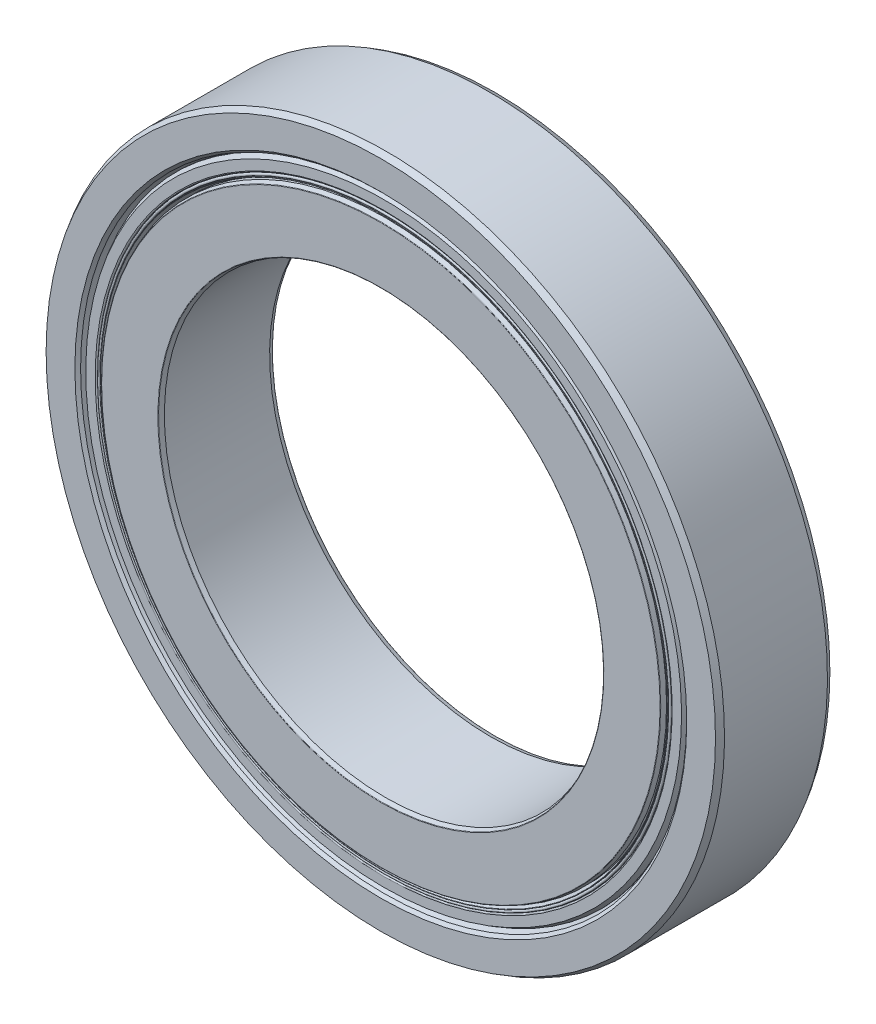
ISO-10303-21;
HEADER;
FILE_DESCRIPTION(('STEP AP214'),'2;1');
FILE_NAME('part.step','',(''),(''),'','','');
FILE_SCHEMA(('AUTOMOTIVE_DESIGN { 1 0 10303 214 1 1 1 1 }'));
ENDSEC;
DATA;
#1=APPLICATION_CONTEXT('core data for automotive mechanical design processes');
#2=APPLICATION_PROTOCOL_DEFINITION('international standard','automotive_design',2000,#1);
#3=PRODUCT_CONTEXT('',#1,'mechanical');
#4=PRODUCT('Part','Part','',(#3));
#5=PRODUCT_RELATED_PRODUCT_CATEGORY('part','',(#4));
#6=PRODUCT_DEFINITION_FORMATION('','',#4);
#7=PRODUCT_DEFINITION_CONTEXT('part definition',#1,'design');
#8=PRODUCT_DEFINITION('design','',#6,#7);
#9=PRODUCT_DEFINITION_SHAPE('','',#8);
#10=(LENGTH_UNIT() NAMED_UNIT(*) SI_UNIT(.MILLI.,.METRE.));
#11=(NAMED_UNIT(*) PLANE_ANGLE_UNIT() SI_UNIT($,.RADIAN.));
#12=(NAMED_UNIT(*) SI_UNIT($,.STERADIAN.) SOLID_ANGLE_UNIT());
#13=UNCERTAINTY_MEASURE_WITH_UNIT(LENGTH_MEASURE(1.E-05),#10,'distance_accuracy_value','');
#14=(GEOMETRIC_REPRESENTATION_CONTEXT(3) GLOBAL_UNCERTAINTY_ASSIGNED_CONTEXT((#13)) GLOBAL_UNIT_ASSIGNED_CONTEXT((#10,
#11,#12)) REPRESENTATION_CONTEXT('',''));
#15=CARTESIAN_POINT('',(0.,0.,0.));
#16=DIRECTION('',(0.,0.,1.));
#17=DIRECTION('',(1.,0.,0.));
#18=AXIS2_PLACEMENT_3D('',#15,#16,#17);
#19=CARTESIAN_POINT('',(0.,0.,11.));
#20=DIRECTION('',(0.,0.,1.));
#21=DIRECTION('',(0.,-1.,0.));
#22=AXIS2_PLACEMENT_3D('',#19,#20,#21);
#23=CYLINDRICAL_SURFACE('',#22,55.2001046153846);
#24=CARTESIAN_POINT('',(0.,0.,-5.4624476923077));
#25=DIRECTION('',(0.,0.,1.));
#26=DIRECTION('',(0.,-1.,0.));
#27=AXIS2_PLACEMENT_3D('',#24,#25,#26);
#28=CIRCLE('',#27,55.2001046153846);
#29=CARTESIAN_POINT('',(0.,-55.2001046153846,-5.46244769230771));
#30=VERTEX_POINT('',#29);
#31=EDGE_CURVE('E11',#30,#30,#28,.T.);
#32=ORIENTED_EDGE('',*,*,#31,.F.);
#33=EDGE_LOOP('',(#32));
#34=FACE_BOUND('',#33,.T.);
#35=CARTESIAN_POINT('',(0.,0.,-10.16875));
#36=DIRECTION('',(0.,0.,1.));
#37=DIRECTION('',(0.,-1.,0.));
#38=AXIS2_PLACEMENT_3D('',#35,#36,#37);
#39=CIRCLE('',#38,55.2001046153846);
#40=CARTESIAN_POINT('',(0.,-55.2001046153846,-10.16875));
#41=VERTEX_POINT('',#40);
#42=EDGE_CURVE('E77',#41,#41,#39,.T.);
#43=ORIENTED_EDGE('',*,*,#42,.T.);
#44=EDGE_LOOP('',(#43));
#45=FACE_BOUND('',#44,.T.);
#46=ADVANCED_FACE('F52',(#34,#45),#23,.T.);
#47=CARTESIAN_POINT('',(0.,55.2001046153846,-5.46244769230769));
#48=DIRECTION('',(0.,0.,-1.));
#49=DIRECTION('',(0.,1.,0.));
#50=AXIS2_PLACEMENT_3D('',#47,#48,#49);
#51=PLANE('',#50);
#52=CARTESIAN_POINT('',(0.,0.,-5.4624476923077));
#53=DIRECTION('',(0.,0.,1.));
#54=DIRECTION('',(0.,-1.,0.));
#55=AXIS2_PLACEMENT_3D('',#52,#53,#54);
#56=CIRCLE('',#55,54.0751046153846);
#57=CARTESIAN_POINT('',(0.,-54.0751046153846,-5.46244769230771));
#58=VERTEX_POINT('',#57);
#59=EDGE_CURVE('E58',#58,#58,#56,.T.);
#60=ORIENTED_EDGE('',*,*,#59,.F.);
#61=EDGE_LOOP('',(#60));
#62=FACE_BOUND('',#61,.T.);
#63=ORIENTED_EDGE('',*,*,#31,.T.);
#64=EDGE_LOOP('',(#63));
#65=FACE_BOUND('',#64,.T.);
#66=ADVANCED_FACE('F108',(#62,#65),#51,.F.);
#67=CARTESIAN_POINT('',(0.,0.,11.));
#68=DIRECTION('',(0.,0.,1.));
#69=DIRECTION('',(0.,-1.,0.));
#70=AXIS2_PLACEMENT_3D('',#67,#68,#69);
#71=CYLINDRICAL_SURFACE('',#70,54.0751046153846);
#72=CARTESIAN_POINT('',(0.,0.,-9.16146445163574));
#73=DIRECTION('',(0.,0.,1.));
#74=DIRECTION('',(0.,-1.,0.));
#75=AXIS2_PLACEMENT_3D('',#72,#73,#74);
#76=CIRCLE('',#75,54.0751046153846);
#77=CARTESIAN_POINT('',(0.,-54.0751046153846,-9.16146445163576));
#78=VERTEX_POINT('',#77);
#79=EDGE_CURVE('E62',#78,#78,#76,.T.);
#80=ORIENTED_EDGE('',*,*,#79,.F.);
#81=EDGE_LOOP('',(#80));
#82=FACE_BOUND('',#81,.T.);
#83=ORIENTED_EDGE('',*,*,#59,.T.);
#84=EDGE_LOOP('',(#83));
#85=FACE_BOUND('',#84,.T.);
#86=ADVANCED_FACE('F103',(#82,#85),#71,.F.);
#87=CARTESIAN_POINT('',(0.,0.,-9.16146445163574));
#88=DIRECTION('',(0.,0.,-1.));
#89=DIRECTION('',(0.,1.,0.));
#90=AXIS2_PLACEMENT_3D('',#87,#88,#89);
#91=CONICAL_SURFACE('',#90,54.0751046153846,0.34906585039886);
#92=CARTESIAN_POINT('',(0.,0.,-10.4138111078829));
#93=DIRECTION('',(0.,0.,1.));
#94=DIRECTION('',(0.,-1.,0.));
#95=AXIS2_PLACEMENT_3D('',#92,#93,#94);
#96=CIRCLE('',#95,54.5309215212414);
#97=CARTESIAN_POINT('',(0.,-54.5309215212414,-10.4138111078829));
#98=VERTEX_POINT('',#97);
#99=EDGE_CURVE('E66',#98,#98,#96,.T.);
#100=ORIENTED_EDGE('',*,*,#99,.F.);
#101=EDGE_LOOP('',(#100));
#102=FACE_BOUND('',#101,.T.);
#103=ORIENTED_EDGE('',*,*,#79,.T.);
#104=EDGE_LOOP('',(#103));
#105=FACE_BOUND('',#104,.T.);
#106=ADVANCED_FACE('F97',(#102,#105),#91,.F.);
#107=CARTESIAN_POINT('',(0.,0.,-10.395));
#108=DIRECTION('',(0.,0.,1.));
#109=DIRECTION('',(0.,-1.,0.));
#110=AXIS2_PLACEMENT_3D('',#107,#108,#109);
#111=TOROIDAL_SURFACE('',#110,54.5826046153846,0.0550000000000032);
#112=CARTESIAN_POINT('',(0.,0.,-10.395));
#113=DIRECTION('',(0.,0.,1.));
#114=DIRECTION('',(0.,-1.,0.));
#115=AXIS2_PLACEMENT_3D('',#112,#113,#114);
#116=CIRCLE('',#115,54.6376046153846);
#117=CARTESIAN_POINT('',(0.,-54.6376046153846,-10.395));
#118=VERTEX_POINT('',#117);
#119=EDGE_CURVE('E71',#118,#118,#116,.T.);
#120=ORIENTED_EDGE('',*,*,#119,.F.);
#121=EDGE_LOOP('',(#120));
#122=FACE_BOUND('',#121,.T.);
#123=ORIENTED_EDGE('',*,*,#99,.T.);
#124=EDGE_LOOP('',(#123));
#125=FACE_BOUND('',#124,.T.);
#126=ADVANCED_FACE('F91',(#122,#125),#111,.T.);
#127=CARTESIAN_POINT('',(0.,0.,11.));
#128=DIRECTION('',(0.,0.,1.));
#129=DIRECTION('',(0.,-1.,0.));
#130=AXIS2_PLACEMENT_3D('',#127,#128,#129);
#131=CYLINDRICAL_SURFACE('',#130,54.6376046153846);
#132=CARTESIAN_POINT('',(0.,0.,-10.16875));
#133=DIRECTION('',(0.,0.,1.));
#134=DIRECTION('',(0.,-1.,0.));
#135=AXIS2_PLACEMENT_3D('',#132,#133,#134);
#136=CIRCLE('',#135,54.6376046153846);
#137=CARTESIAN_POINT('',(0.,-54.6376046153846,-10.16875));
#138=VERTEX_POINT('',#137);
#139=EDGE_CURVE('E74',#138,#138,#136,.T.);
#140=ORIENTED_EDGE('',*,*,#139,.F.);
#141=EDGE_LOOP('',(#140));
#142=FACE_BOUND('',#141,.T.);
#143=ORIENTED_EDGE('',*,*,#119,.T.);
#144=EDGE_LOOP('',(#143));
#145=FACE_BOUND('',#144,.T.);
#146=ADVANCED_FACE('F85',(#142,#145),#131,.T.);
#147=CARTESIAN_POINT('',(0.,0.,-10.16875));
#148=DIRECTION('',(0.,0.,1.));
#149=DIRECTION('',(0.,-1.,0.));
#150=AXIS2_PLACEMENT_3D('',#147,#148,#149);
#151=TOROIDAL_SURFACE('',#150,54.9188546153846,0.281249999999997);
#152=ORIENTED_EDGE('',*,*,#42,.F.);
#153=EDGE_LOOP('',(#152));
#154=FACE_BOUND('',#153,.T.);
#155=ORIENTED_EDGE('',*,*,#139,.T.);
#156=EDGE_LOOP('',(#155));
#157=FACE_BOUND('',#156,.T.);
#158=ADVANCED_FACE('F82',(#154,#157),#151,.T.);
#159=CLOSED_SHELL('',(#46,#66,#86,#106,#126,#146,#158));
#160=MANIFOLD_SOLID_BREP('B2',#159);
#161=CARTESIAN_POINT('',(0.,55.2001046153846,5.4624476923077));
#162=DIRECTION('',(0.,0.,1.));
#163=DIRECTION('',(0.,-1.,0.));
#164=AXIS2_PLACEMENT_3D('',#161,#162,#163);
#165=PLANE('',#164);
#166=CARTESIAN_POINT('',(0.,0.,5.46244769230769));
#167=DIRECTION('',(0.,0.,1.));
#168=DIRECTION('',(0.,-1.,0.));
#169=AXIS2_PLACEMENT_3D('',#166,#167,#168);
#170=CIRCLE('',#169,55.2001046153846);
#171=CARTESIAN_POINT('',(0.,-55.2001046153846,5.46244769230768));
#172=VERTEX_POINT('',#171);
#173=EDGE_CURVE('E178',#172,#172,#170,.T.);
#174=ORIENTED_EDGE('',*,*,#173,.F.);
#175=EDGE_LOOP('',(#174));
#176=FACE_BOUND('',#175,.T.);
#177=CARTESIAN_POINT('',(0.,0.,5.46244769230769));
#178=DIRECTION('',(0.,0.,1.));
#179=DIRECTION('',(0.,-1.,0.));
#180=AXIS2_PLACEMENT_3D('',#177,#178,#179);
#181=CIRCLE('',#180,54.0751046153846);
#182=CARTESIAN_POINT('',(0.,-54.0751046153846,5.46244769230768));
#183=VERTEX_POINT('',#182);
#184=EDGE_CURVE('E51',#183,#183,#181,.T.);
#185=ORIENTED_EDGE('',*,*,#184,.T.);
#186=EDGE_LOOP('',(#185));
#187=FACE_BOUND('',#186,.T.);
#188=ADVANCED_FACE('F153',(#176,#187),#165,.F.);
#189=CARTESIAN_POINT('',(0.,0.,11.));
#190=DIRECTION('',(0.,0.,1.));
#191=DIRECTION('',(0.,-1.,0.));
#192=AXIS2_PLACEMENT_3D('',#189,#190,#191);
#193=CYLINDRICAL_SURFACE('',#192,54.0751046153846);
#194=ORIENTED_EDGE('',*,*,#184,.F.);
#195=EDGE_LOOP('',(#194));
#196=FACE_BOUND('',#195,.T.);
#197=CARTESIAN_POINT('',(0.,0.,9.16146445163573));
#198=DIRECTION('',(0.,0.,1.));
#199=DIRECTION('',(0.,-1.,0.));
#200=AXIS2_PLACEMENT_3D('',#197,#198,#199);
#201=CIRCLE('',#200,54.0751046153846);
#202=CARTESIAN_POINT('',(0.,-54.0751046153846,9.16146445163572));
#203=VERTEX_POINT('',#202);
#204=EDGE_CURVE('E159',#203,#203,#201,.T.);
#205=ORIENTED_EDGE('',*,*,#204,.T.);
#206=EDGE_LOOP('',(#205));
#207=FACE_BOUND('',#206,.T.);
#208=ADVANCED_FACE('F185',(#196,#207),#193,.F.);
#209=CARTESIAN_POINT('',(0.,0.,10.4138111078829));
#210=DIRECTION('',(0.,0.,1.));
#211=DIRECTION('',(0.,-1.,0.));
#212=AXIS2_PLACEMENT_3D('',#209,#210,#211);
#213=CONICAL_SURFACE('',#212,54.5309215212414,0.34906585039886);
#214=ORIENTED_EDGE('',*,*,#204,.F.);
#215=EDGE_LOOP('',(#214));
#216=FACE_BOUND('',#215,.T.);
#217=CARTESIAN_POINT('',(0.,0.,10.4138111078829));
#218=DIRECTION('',(0.,0.,1.));
#219=DIRECTION('',(0.,-1.,0.));
#220=AXIS2_PLACEMENT_3D('',#217,#218,#219);
#221=CIRCLE('',#220,54.5309215212414);
#222=CARTESIAN_POINT('',(0.,-54.5309215212414,10.4138111078829));
#223=VERTEX_POINT('',#222);
#224=EDGE_CURVE('E163',#223,#223,#221,.T.);
#225=ORIENTED_EDGE('',*,*,#224,.T.);
#226=EDGE_LOOP('',(#225));
#227=FACE_BOUND('',#226,.T.);
#228=ADVANCED_FACE('F189',(#216,#227),#213,.F.);
#229=CARTESIAN_POINT('',(0.,0.,10.395));
#230=DIRECTION('',(0.,0.,1.));
#231=DIRECTION('',(0.,-1.,0.));
#232=AXIS2_PLACEMENT_3D('',#229,#230,#231);
#233=TOROIDAL_SURFACE('',#232,54.5826046153846,0.0550000000000032);
#234=ORIENTED_EDGE('',*,*,#224,.F.);
#235=EDGE_LOOP('',(#234));
#236=FACE_BOUND('',#235,.T.);
#237=CARTESIAN_POINT('',(0.,0.,10.395));
#238=DIRECTION('',(0.,0.,1.));
#239=DIRECTION('',(0.,-1.,0.));
#240=AXIS2_PLACEMENT_3D('',#237,#238,#239);
#241=CIRCLE('',#240,54.6376046153846);
#242=CARTESIAN_POINT('',(0.,-54.6376046153846,10.395));
#243=VERTEX_POINT('',#242);
#244=EDGE_CURVE('E167',#243,#243,#241,.T.);
#245=ORIENTED_EDGE('',*,*,#244,.T.);
#246=EDGE_LOOP('',(#245));
#247=FACE_BOUND('',#246,.T.);
#248=ADVANCED_FACE('F194',(#236,#247),#233,.T.);
#249=CARTESIAN_POINT('',(0.,0.,11.));
#250=DIRECTION('',(0.,0.,1.));
#251=DIRECTION('',(0.,-1.,0.));
#252=AXIS2_PLACEMENT_3D('',#249,#250,#251);
#253=CYLINDRICAL_SURFACE('',#252,54.6376046153846);
#254=ORIENTED_EDGE('',*,*,#244,.F.);
#255=EDGE_LOOP('',(#254));
#256=FACE_BOUND('',#255,.T.);
#257=CARTESIAN_POINT('',(0.,0.,10.16875));
#258=DIRECTION('',(0.,0.,1.));
#259=DIRECTION('',(0.,-1.,0.));
#260=AXIS2_PLACEMENT_3D('',#257,#258,#259);
#261=CIRCLE('',#260,54.6376046153846);
#262=CARTESIAN_POINT('',(0.,-54.6376046153846,10.16875));
#263=VERTEX_POINT('',#262);
#264=EDGE_CURVE('E172',#263,#263,#261,.T.);
#265=ORIENTED_EDGE('',*,*,#264,.T.);
#266=EDGE_LOOP('',(#265));
#267=FACE_BOUND('',#266,.T.);
#268=ADVANCED_FACE('F200',(#256,#267),#253,.T.);
#269=CARTESIAN_POINT('',(0.,0.,10.16875));
#270=DIRECTION('',(0.,0.,1.));
#271=DIRECTION('',(0.,-1.,0.));
#272=AXIS2_PLACEMENT_3D('',#269,#270,#271);
#273=TOROIDAL_SURFACE('',#272,54.9188546153846,0.281249999999997);
#274=ORIENTED_EDGE('',*,*,#264,.F.);
#275=EDGE_LOOP('',(#274));
#276=FACE_BOUND('',#275,.T.);
#277=CARTESIAN_POINT('',(0.,0.,10.16875));
#278=DIRECTION('',(0.,0.,1.));
#279=DIRECTION('',(0.,-1.,0.));
#280=AXIS2_PLACEMENT_3D('',#277,#278,#279);
#281=CIRCLE('',#280,55.2001046153846);
#282=CARTESIAN_POINT('',(0.,-55.2001046153846,10.16875));
#283=VERTEX_POINT('',#282);
#284=EDGE_CURVE('E175',#283,#283,#281,.T.);
#285=ORIENTED_EDGE('',*,*,#284,.T.);
#286=EDGE_LOOP('',(#285));
#287=FACE_BOUND('',#286,.T.);
#288=ADVANCED_FACE('F204',(#276,#287),#273,.T.);
#289=CARTESIAN_POINT('',(0.,0.,11.));
#290=DIRECTION('',(0.,0.,1.));
#291=DIRECTION('',(0.,-1.,0.));
#292=AXIS2_PLACEMENT_3D('',#289,#290,#291);
#293=CYLINDRICAL_SURFACE('',#292,55.2001046153846);
#294=ORIENTED_EDGE('',*,*,#284,.F.);
#295=EDGE_LOOP('',(#294));
#296=FACE_BOUND('',#295,.T.);
#297=ORIENTED_EDGE('',*,*,#173,.T.);
#298=EDGE_LOOP('',(#297));
#299=FACE_BOUND('',#298,.T.);
#300=ADVANCED_FACE('F182',(#296,#299),#293,.T.);
#301=CLOSED_SHELL('',(#188,#208,#228,#248,#268,#288,#300));
#302=MANIFOLD_SOLID_BREP('B6',#301);
#303=CARTESIAN_POINT('',(0.,0.,-10.45));
#304=DIRECTION('',(0.,0.,1.));
#305=DIRECTION('',(0.,-1.,0.));
#306=AXIS2_PLACEMENT_3D('',#303,#304,#305);
#307=CONICAL_SURFACE('',#306,57.2875,0.523598775598289);
#308=CARTESIAN_POINT('',(0.,0.,-9.47572142074249));
#309=DIRECTION('',(0.,0.,1.));
#310=DIRECTION('',(0.,-1.,0.));
#311=AXIS2_PLACEMENT_3D('',#308,#309,#310);
#312=CIRCLE('',#311,57.85);
#313=CARTESIAN_POINT('',(0.,-57.85,-9.4757214207425));
#314=VERTEX_POINT('',#313);
#315=EDGE_CURVE('E276',#314,#314,#312,.T.);
#316=ORIENTED_EDGE('',*,*,#315,.F.);
#317=EDGE_LOOP('',(#316));
#318=FACE_BOUND('',#317,.T.);
#319=CARTESIAN_POINT('',(0.,0.,-10.45));
#320=DIRECTION('',(0.,0.,1.));
#321=DIRECTION('',(0.,-1.,0.));
#322=AXIS2_PLACEMENT_3D('',#319,#320,#321);
#323=CIRCLE('',#322,57.2875);
#324=CARTESIAN_POINT('',(0.,-57.2875,-10.45));
#325=VERTEX_POINT('',#324);
#326=EDGE_CURVE('E152',#325,#325,#323,.T.);
#327=ORIENTED_EDGE('',*,*,#326,.T.);
#328=EDGE_LOOP('',(#327));
#329=FACE_BOUND('',#328,.T.);
#330=ADVANCED_FACE('F254',(#318,#329),#307,.T.);
#331=CARTESIAN_POINT('',(0.,57.2875,-10.45));
#332=DIRECTION('',(0.,0.,1.));
#333=DIRECTION('',(0.,-1.,0.));
#334=AXIS2_PLACEMENT_3D('',#331,#332,#333);
#335=PLANE('',#334);
#336=ORIENTED_EDGE('',*,*,#326,.F.);
#337=EDGE_LOOP('',(#336));
#338=FACE_BOUND('',#337,.T.);
#339=CARTESIAN_POINT('',(0.,0.,-10.45));
#340=DIRECTION('',(0.,0.,1.));
#341=DIRECTION('',(0.,-1.,0.));
#342=AXIS2_PLACEMENT_3D('',#339,#340,#341);
#343=CIRCLE('',#342,55.4813546153846);
#344=CARTESIAN_POINT('',(0.,-55.4813546153846,-10.45));
#345=VERTEX_POINT('',#344);
#346=EDGE_CURVE('E260',#345,#345,#343,.T.);
#347=ORIENTED_EDGE('',*,*,#346,.T.);
#348=EDGE_LOOP('',(#347));
#349=FACE_BOUND('',#348,.T.);
#350=ADVANCED_FACE('F283',(#338,#349),#335,.F.);
#351=CARTESIAN_POINT('',(0.,0.,-10.16875));
#352=DIRECTION('',(0.,0.,1.));
#353=DIRECTION('',(0.,-1.,0.));
#354=AXIS2_PLACEMENT_3D('',#351,#352,#353);
#355=TOROIDAL_SURFACE('',#354,55.4813546153846,0.281250000000001);
#356=ORIENTED_EDGE('',*,*,#346,.F.);
#357=EDGE_LOOP('',(#356));
#358=FACE_BOUND('',#357,.T.);
#359=CARTESIAN_POINT('',(0.,0.,-10.16875));
#360=DIRECTION('',(0.,0.,1.));
#361=DIRECTION('',(0.,-1.,0.));
#362=AXIS2_PLACEMENT_3D('',#359,#360,#361);
#363=CIRCLE('',#362,55.2001046153846);
#364=CARTESIAN_POINT('',(0.,-55.2001046153846,-10.16875));
#365=VERTEX_POINT('',#364);
#366=EDGE_CURVE('E264',#365,#365,#363,.T.);
#367=ORIENTED_EDGE('',*,*,#366,.T.);
#368=EDGE_LOOP('',(#367));
#369=FACE_BOUND('',#368,.T.);
#370=ADVANCED_FACE('F287',(#358,#369),#355,.T.);
#371=CARTESIAN_POINT('',(0.,0.,11.));
#372=DIRECTION('',(0.,0.,1.));
#373=DIRECTION('',(0.,-1.,0.));
#374=AXIS2_PLACEMENT_3D('',#371,#372,#373);
#375=CYLINDRICAL_SURFACE('',#374,55.2001046153846);
#376=ORIENTED_EDGE('',*,*,#366,.F.);
#377=EDGE_LOOP('',(#376));
#378=FACE_BOUND('',#377,.T.);
#379=CARTESIAN_POINT('',(0.,0.,-5.4624476923077));
#380=DIRECTION('',(0.,0.,1.));
#381=DIRECTION('',(0.,-1.,0.));
#382=AXIS2_PLACEMENT_3D('',#379,#380,#381);
#383=CIRCLE('',#382,55.2001046153846);
#384=CARTESIAN_POINT('',(0.,-55.2001046153846,-5.46244769230771));
#385=VERTEX_POINT('',#384);
#386=EDGE_CURVE('E268',#385,#385,#383,.T.);
#387=ORIENTED_EDGE('',*,*,#386,.T.);
#388=EDGE_LOOP('',(#387));
#389=FACE_BOUND('',#388,.T.);
#390=ADVANCED_FACE('F292',(#378,#389),#375,.F.);
#391=CARTESIAN_POINT('',(0.,57.85,-5.46244769230769));
#392=DIRECTION('',(0.,0.,-1.));
#393=DIRECTION('',(0.,1.,0.));
#394=AXIS2_PLACEMENT_3D('',#391,#392,#393);
#395=PLANE('',#394);
#396=ORIENTED_EDGE('',*,*,#386,.F.);
#397=EDGE_LOOP('',(#396));
#398=FACE_BOUND('',#397,.T.);
#399=CARTESIAN_POINT('',(0.,0.,-5.4624476923077));
#400=DIRECTION('',(0.,0.,1.));
#401=DIRECTION('',(0.,-1.,0.));
#402=AXIS2_PLACEMENT_3D('',#399,#400,#401);
#403=CIRCLE('',#402,57.85);
#404=CARTESIAN_POINT('',(0.,-57.85,-5.46244769230771));
#405=VERTEX_POINT('',#404);
#406=EDGE_CURVE('E273',#405,#405,#403,.T.);
#407=ORIENTED_EDGE('',*,*,#406,.T.);
#408=EDGE_LOOP('',(#407));
#409=FACE_BOUND('',#408,.T.);
#410=ADVANCED_FACE('F298',(#398,#409),#395,.F.);
#411=CARTESIAN_POINT('',(0.,0.,11.));
#412=DIRECTION('',(0.,0.,1.));
#413=DIRECTION('',(0.,-1.,0.));
#414=AXIS2_PLACEMENT_3D('',#411,#412,#413);
#415=CYLINDRICAL_SURFACE('',#414,57.85);
#416=ORIENTED_EDGE('',*,*,#406,.F.);
#417=EDGE_LOOP('',(#416));
#418=FACE_BOUND('',#417,.T.);
#419=ORIENTED_EDGE('',*,*,#315,.T.);
#420=EDGE_LOOP('',(#419));
#421=FACE_BOUND('',#420,.T.);
#422=ADVANCED_FACE('F280',(#418,#421),#415,.T.);
#423=CLOSED_SHELL('',(#330,#350,#370,#390,#410,#422));
#424=MANIFOLD_SOLID_BREP('B46',#423);
#425=CARTESIAN_POINT('',(0.,57.85,5.4624476923077));
#426=DIRECTION('',(0.,0.,1.));
#427=DIRECTION('',(0.,-1.,0.));
#428=AXIS2_PLACEMENT_3D('',#425,#426,#427);
#429=PLANE('',#428);
#430=CARTESIAN_POINT('',(0.,0.,5.46244769230769));
#431=DIRECTION('',(0.,0.,1.));
#432=DIRECTION('',(0.,-1.,0.));
#433=AXIS2_PLACEMENT_3D('',#430,#431,#432);
#434=CIRCLE('',#433,57.85);
#435=CARTESIAN_POINT('',(0.,-57.85,5.46244769230768));
#436=VERTEX_POINT('',#435);
#437=EDGE_CURVE('E253',#436,#436,#434,.T.);
#438=ORIENTED_EDGE('',*,*,#437,.F.);
#439=EDGE_LOOP('',(#438));
#440=FACE_BOUND('',#439,.T.);
#441=CARTESIAN_POINT('',(0.,0.,5.46244769230769));
#442=DIRECTION('',(0.,0.,1.));
#443=DIRECTION('',(0.,-1.,0.));
#444=AXIS2_PLACEMENT_3D('',#441,#442,#443);
#445=CIRCLE('',#444,55.2001046153846);
#446=CARTESIAN_POINT('',(0.,-55.2001046153846,5.46244769230768));
#447=VERTEX_POINT('',#446);
#448=EDGE_CURVE('E362',#447,#447,#445,.T.);
#449=ORIENTED_EDGE('',*,*,#448,.T.);
#450=EDGE_LOOP('',(#449));
#451=FACE_BOUND('',#450,.T.);
#452=ADVANCED_FACE('F340',(#440,#451),#429,.F.);
#453=CARTESIAN_POINT('',(0.,0.,11.));
#454=DIRECTION('',(0.,0.,1.));
#455=DIRECTION('',(0.,-1.,0.));
#456=AXIS2_PLACEMENT_3D('',#453,#454,#455);
#457=CYLINDRICAL_SURFACE('',#456,57.85);
#458=CARTESIAN_POINT('',(0.,0.,9.47572142074248));
#459=DIRECTION('',(0.,0.,1.));
#460=DIRECTION('',(0.,-1.,0.));
#461=AXIS2_PLACEMENT_3D('',#458,#459,#460);
#462=CIRCLE('',#461,57.85);
#463=CARTESIAN_POINT('',(0.,-57.85,9.47572142074246));
#464=VERTEX_POINT('',#463);
#465=EDGE_CURVE('E346',#464,#464,#462,.T.);
#466=ORIENTED_EDGE('',*,*,#465,.F.);
#467=EDGE_LOOP('',(#466));
#468=FACE_BOUND('',#467,.T.);
#469=ORIENTED_EDGE('',*,*,#437,.T.);
#470=EDGE_LOOP('',(#469));
#471=FACE_BOUND('',#470,.T.);
#472=ADVANCED_FACE('F387',(#468,#471),#457,.T.);
#473=CARTESIAN_POINT('',(0.,0.,9.47572142074248));
#474=DIRECTION('',(0.,0.,-1.));
#475=DIRECTION('',(0.,1.,0.));
#476=AXIS2_PLACEMENT_3D('',#473,#474,#475);
#477=CONICAL_SURFACE('',#476,57.85,0.523598775598289);
#478=CARTESIAN_POINT('',(0.,0.,10.45));
#479=DIRECTION('',(0.,0.,1.));
#480=DIRECTION('',(0.,-1.,0.));
#481=AXIS2_PLACEMENT_3D('',#478,#479,#480);
#482=CIRCLE('',#481,57.2875);
#483=CARTESIAN_POINT('',(0.,-57.2875,10.45));
#484=VERTEX_POINT('',#483);
#485=EDGE_CURVE('E350',#484,#484,#482,.T.);
#486=ORIENTED_EDGE('',*,*,#485,.F.);
#487=EDGE_LOOP('',(#486));
#488=FACE_BOUND('',#487,.T.);
#489=ORIENTED_EDGE('',*,*,#465,.T.);
#490=EDGE_LOOP('',(#489));
#491=FACE_BOUND('',#490,.T.);
#492=ADVANCED_FACE('F382',(#488,#491),#477,.T.);
#493=CARTESIAN_POINT('',(0.,57.2875,10.45));
#494=DIRECTION('',(0.,0.,-1.));
#495=DIRECTION('',(0.,1.,0.));
#496=AXIS2_PLACEMENT_3D('',#493,#494,#495);
#497=PLANE('',#496);
#498=CARTESIAN_POINT('',(0.,0.,10.45));
#499=DIRECTION('',(0.,0.,1.));
#500=DIRECTION('',(0.,-1.,0.));
#501=AXIS2_PLACEMENT_3D('',#498,#499,#500);
#502=CIRCLE('',#501,55.4813546153846);
#503=CARTESIAN_POINT('',(0.,-55.4813546153846,10.45));
#504=VERTEX_POINT('',#503);
#505=EDGE_CURVE('E354',#504,#504,#502,.T.);
#506=ORIENTED_EDGE('',*,*,#505,.F.);
#507=EDGE_LOOP('',(#506));
#508=FACE_BOUND('',#507,.T.);
#509=ORIENTED_EDGE('',*,*,#485,.T.);
#510=EDGE_LOOP('',(#509));
#511=FACE_BOUND('',#510,.T.);
#512=ADVANCED_FACE('F376',(#508,#511),#497,.F.);
#513=CARTESIAN_POINT('',(0.,0.,10.16875));
#514=DIRECTION('',(0.,0.,1.));
#515=DIRECTION('',(0.,-1.,0.));
#516=AXIS2_PLACEMENT_3D('',#513,#514,#515);
#517=TOROIDAL_SURFACE('',#516,55.4813546153846,0.281250000000001);
#518=CARTESIAN_POINT('',(0.,0.,10.16875));
#519=DIRECTION('',(0.,0.,1.));
#520=DIRECTION('',(0.,-1.,0.));
#521=AXIS2_PLACEMENT_3D('',#518,#519,#520);
#522=CIRCLE('',#521,55.2001046153846);
#523=CARTESIAN_POINT('',(0.,-55.2001046153846,10.16875));
#524=VERTEX_POINT('',#523);
#525=EDGE_CURVE('E359',#524,#524,#522,.T.);
#526=ORIENTED_EDGE('',*,*,#525,.F.);
#527=EDGE_LOOP('',(#526));
#528=FACE_BOUND('',#527,.T.);
#529=ORIENTED_EDGE('',*,*,#505,.T.);
#530=EDGE_LOOP('',(#529));
#531=FACE_BOUND('',#530,.T.);
#532=ADVANCED_FACE('F370',(#528,#531),#517,.T.);
#533=CARTESIAN_POINT('',(0.,0.,11.));
#534=DIRECTION('',(0.,0.,1.));
#535=DIRECTION('',(0.,-1.,0.));
#536=AXIS2_PLACEMENT_3D('',#533,#534,#535);
#537=CYLINDRICAL_SURFACE('',#536,55.2001046153846);
#538=ORIENTED_EDGE('',*,*,#448,.F.);
#539=EDGE_LOOP('',(#538));
#540=FACE_BOUND('',#539,.T.);
#541=ORIENTED_EDGE('',*,*,#525,.T.);
#542=EDGE_LOOP('',(#541));
#543=FACE_BOUND('',#542,.T.);
#544=ADVANCED_FACE('F367',(#540,#543),#537,.F.);
#545=CLOSED_SHELL('',(#452,#472,#492,#512,#532,#544));
#546=MANIFOLD_SOLID_BREP('B147',#545);
#547=CARTESIAN_POINT('',(-48.4649919590767,27.9812761538467,0.));
#548=DIRECTION('',(0.,0.,1.));
#549=DIRECTION('',(-0.866025403784433,0.50000000000001,0.));
#550=AXIS2_PLACEMENT_3D('',#547,#548,#549);
#551=SPHERICAL_SURFACE('',#550,5.46244769230769);
#552=CARTESIAN_POINT('',(-48.4649919590767,27.9812761538467,5.46244769230769));
#553=VERTEX_POINT('',#552);
#554=VERTEX_LOOP('',#553);
#555=FACE_BOUND('',#554,.T.);
#556=ADVANCED_FACE('F447',(#555),#551,.T.);
#557=CLOSED_SHELL('',(#556));
#558=MANIFOLD_SOLID_BREP('B248',#557);
#559=CARTESIAN_POINT('',(-48.4649919590773,-27.9812761538457,0.));
#560=DIRECTION('',(0.,0.,1.));
#561=DIRECTION('',(-0.866025403784443,-0.499999999999992,0.));
#562=AXIS2_PLACEMENT_3D('',#559,#560,#561);
#563=SPHERICAL_SURFACE('',#562,5.46244769230769);
#564=CARTESIAN_POINT('',(-48.4649919590773,-27.9812761538457,5.46244769230768));
#565=VERTEX_POINT('',#564);
#566=VERTEX_LOOP('',#565);
#567=FACE_BOUND('',#566,.T.);
#568=ADVANCED_FACE('F464',(#567),#563,.T.);
#569=CLOSED_SHELL('',(#568));
#570=MANIFOLD_SOLID_BREP('B336',#569);
#571=CARTESIAN_POINT('',(0.,-55.9625523076923,0.));
#572=DIRECTION('',(0.,0.,1.));
#573=DIRECTION('',(0.,-1.,0.));
#574=AXIS2_PLACEMENT_3D('',#571,#572,#573);
#575=SPHERICAL_SURFACE('',#574,5.46244769230769);
#576=CARTESIAN_POINT('',(0.,-55.9625523076923,5.46244769230768));
#577=VERTEX_POINT('',#576);
#578=VERTEX_LOOP('',#577);
#579=FACE_BOUND('',#578,.T.);
#580=ADVANCED_FACE('F481',(#579),#575,.T.);
#581=CLOSED_SHELL('',(#580));
#582=MANIFOLD_SOLID_BREP('B443',#581);
#583=CARTESIAN_POINT('',(48.4649919590769,-27.9812761538464,0.));
#584=DIRECTION('',(0.,0.,1.));
#585=DIRECTION('',(0.866025403784436,-0.500000000000004,0.));
#586=AXIS2_PLACEMENT_3D('',#583,#584,#585);
#587=SPHERICAL_SURFACE('',#586,5.46244769230769);
#588=CARTESIAN_POINT('',(48.4649919590769,-27.9812761538464,5.46244769230768));
#589=VERTEX_POINT('',#588);
#590=VERTEX_LOOP('',#589);
#591=FACE_BOUND('',#590,.T.);
#592=ADVANCED_FACE('F498',(#591),#587,.T.);
#593=CLOSED_SHELL('',(#592));
#594=MANIFOLD_SOLID_BREP('B460',#593);
#595=CARTESIAN_POINT('',(48.4649919590771,27.981276153846,0.));
#596=DIRECTION('',(0.,0.,1.));
#597=DIRECTION('',(0.86602540378444,0.499999999999998,0.));
#598=AXIS2_PLACEMENT_3D('',#595,#596,#597);
#599=SPHERICAL_SURFACE('',#598,5.46244769230769);
#600=CARTESIAN_POINT('',(48.4649919590771,27.981276153846,5.46244769230769));
#601=VERTEX_POINT('',#600);
#602=VERTEX_LOOP('',#601);
#603=FACE_BOUND('',#602,.T.);
#604=ADVANCED_FACE('F515',(#603),#599,.T.);
#605=CLOSED_SHELL('',(#604));
#606=MANIFOLD_SOLID_BREP('B477',#605);
#607=CARTESIAN_POINT('',(0.,55.9625523076923,0.));
#608=DIRECTION('',(0.,0.,1.));
#609=DIRECTION('',(0.,1.,0.));
#610=AXIS2_PLACEMENT_3D('',#607,#608,#609);
#611=SPHERICAL_SURFACE('',#610,5.46244769230769);
#612=CARTESIAN_POINT('',(0.,55.9625523076923,5.4624476923077));
#613=VERTEX_POINT('',#612);
#614=VERTEX_LOOP('',#613);
#615=FACE_BOUND('',#614,.T.);
#616=ADVANCED_FACE('F534',(#615),#611,.T.);
#617=CLOSED_SHELL('',(#616));
#618=MANIFOLD_SOLID_BREP('B494',#617);
#619=CARTESIAN_POINT('',(0.,0.,-10.89));
#620=DIRECTION('',(0.,0.,1.));
#621=DIRECTION('',(0.,-1.,0.));
#622=AXIS2_PLACEMENT_3D('',#619,#620,#621);
#623=TOROIDAL_SURFACE('',#622,42.8973166353573,0.110000000000001);
#624=CARTESIAN_POINT('',(0.,0.,-11.));
#625=DIRECTION('',(0.,0.,1.));
#626=DIRECTION('',(0.,-1.,0.));
#627=AXIS2_PLACEMENT_3D('',#624,#625,#626);
#628=CIRCLE('',#627,42.8973166353573);
#629=CARTESIAN_POINT('',(0.,-42.8973166353573,-11.));
#630=VERTEX_POINT('',#629);
#631=EDGE_CURVE('E533',#630,#630,#628,.T.);
#632=ORIENTED_EDGE('',*,*,#631,.F.);
#633=EDGE_LOOP('',(#632));
#634=FACE_BOUND('',#633,.T.);
#635=CARTESIAN_POINT('',(0.,0.,-10.9276222157658));
#636=DIRECTION('',(0.,0.,1.));
#637=DIRECTION('',(0.,-1.,0.));
#638=AXIS2_PLACEMENT_3D('',#635,#636,#637);
#639=CIRCLE('',#638,42.7939504470709);
#640=CARTESIAN_POINT('',(0.,-42.7939504470709,-10.9276222157658));
#641=VERTEX_POINT('',#640);
#642=EDGE_CURVE('E611',#641,#641,#639,.T.);
#643=ORIENTED_EDGE('',*,*,#642,.T.);
#644=EDGE_LOOP('',(#643));
#645=FACE_BOUND('',#644,.T.);
#646=ADVANCED_FACE('F552',(#634,#645),#623,.T.);
#647=CARTESIAN_POINT('',(0.,42.8973166353573,-11.));
#648=DIRECTION('',(0.,0.,1.));
#649=DIRECTION('',(0.,-1.,0.));
#650=AXIS2_PLACEMENT_3D('',#647,#648,#649);
#651=PLANE('',#650);
#652=CARTESIAN_POINT('',(0.,0.,-11.));
#653=DIRECTION('',(0.,0.,1.));
#654=DIRECTION('',(0.,-1.,0.));
#655=AXIS2_PLACEMENT_3D('',#652,#653,#654);
#656=CIRCLE('',#655,53.6777879800273);
#657=CARTESIAN_POINT('',(0.,-53.6777879800273,-11.));
#658=VERTEX_POINT('',#657);
#659=EDGE_CURVE('E559',#658,#658,#656,.T.);
#660=ORIENTED_EDGE('',*,*,#659,.F.);
#661=EDGE_LOOP('',(#660));
#662=FACE_BOUND('',#661,.T.);
#663=ORIENTED_EDGE('',*,*,#631,.T.);
#664=EDGE_LOOP('',(#663));
#665=FACE_BOUND('',#664,.T.);
#666=ADVANCED_FACE('F685',(#662,#665),#651,.F.);
#667=CARTESIAN_POINT('',(0.,0.,-10.89));
#668=DIRECTION('',(0.,0.,1.));
#669=DIRECTION('',(0.,-1.,0.));
#670=AXIS2_PLACEMENT_3D('',#667,#668,#669);
#671=TOROIDAL_SURFACE('',#670,53.6777879800273,0.110000000000001);
#672=CARTESIAN_POINT('',(0.,0.,-10.9276222157658));
#673=DIRECTION('',(0.,0.,1.));
#674=DIRECTION('',(0.,-1.,0.));
#675=AXIS2_PLACEMENT_3D('',#672,#673,#674);
#676=CIRCLE('',#675,53.7811541683137);
#677=CARTESIAN_POINT('',(0.,-53.7811541683137,-10.9276222157658));
#678=VERTEX_POINT('',#677);
#679=EDGE_CURVE('E564',#678,#678,#676,.T.);
#680=ORIENTED_EDGE('',*,*,#679,.F.);
#681=EDGE_LOOP('',(#680));
#682=FACE_BOUND('',#681,.T.);
#683=ORIENTED_EDGE('',*,*,#659,.T.);
#684=EDGE_LOOP('',(#683));
#685=FACE_BOUND('',#684,.T.);
#686=ADVANCED_FACE('F680',(#682,#685),#671,.T.);
#687=CARTESIAN_POINT('',(0.,0.,-10.9276222157658));
#688=DIRECTION('',(0.,0.,1.));
#689=DIRECTION('',(0.,-1.,0.));
#690=AXIS2_PLACEMENT_3D('',#687,#688,#689);
#691=CONICAL_SURFACE('',#690,53.7811541683137,0.34906585039888);
#692=CARTESIAN_POINT('',(0.,0.,-10.12));
#693=DIRECTION('',(0.,0.,1.));
#694=DIRECTION('',(0.,-1.,0.));
#695=AXIS2_PLACEMENT_3D('',#692,#693,#694);
#696=CIRCLE('',#695,54.0751046153846);
#697=CARTESIAN_POINT('',(0.,-54.0751046153846,-10.12));
#698=VERTEX_POINT('',#697);
#699=EDGE_CURVE('E569',#698,#698,#696,.T.);
#700=ORIENTED_EDGE('',*,*,#699,.F.);
#701=EDGE_LOOP('',(#700));
#702=FACE_BOUND('',#701,.T.);
#703=ORIENTED_EDGE('',*,*,#679,.T.);
#704=EDGE_LOOP('',(#703));
#705=FACE_BOUND('',#704,.T.);
#706=ADVANCED_FACE('F674',(#702,#705),#691,.T.);
#707=CARTESIAN_POINT('',(0.,0.,11.));
#708=DIRECTION('',(0.,0.,1.));
#709=DIRECTION('',(0.,-1.,0.));
#710=AXIS2_PLACEMENT_3D('',#707,#708,#709);
#711=CYLINDRICAL_SURFACE('',#710,54.0751046153846);
#712=CARTESIAN_POINT('',(0.,0.,-5.126));
#713=DIRECTION('',(0.,0.,1.));
#714=DIRECTION('',(0.,-1.,0.));
#715=AXIS2_PLACEMENT_3D('',#712,#713,#714);
#716=CIRCLE('',#715,54.0751046153846);
#717=CARTESIAN_POINT('',(0.,-54.0751046153846,-5.12600000000001));
#718=VERTEX_POINT('',#717);
#719=EDGE_CURVE('E575',#718,#718,#716,.T.);
#720=ORIENTED_EDGE('',*,*,#719,.F.);
#721=EDGE_LOOP('',(#720));
#722=FACE_BOUND('',#721,.T.);
#723=ORIENTED_EDGE('',*,*,#699,.T.);
#724=EDGE_LOOP('',(#723));
#725=FACE_BOUND('',#724,.T.);
#726=ADVANCED_FACE('F668',(#722,#725),#711,.T.);
#727=CARTESIAN_POINT('',(0.,0.,0.));
#728=DIRECTION('',(0.,0.,1.));
#729=DIRECTION('',(0.,-1.,0.));
#730=AXIS2_PLACEMENT_3D('',#727,#728,#729);
#731=TOROIDAL_SURFACE('',#730,55.9625523076923,5.46244769230769);
#732=CARTESIAN_POINT('',(0.,0.,5.12599999999999));
#733=DIRECTION('',(0.,0.,1.));
#734=DIRECTION('',(0.,-1.,0.));
#735=AXIS2_PLACEMENT_3D('',#732,#733,#734);
#736=CIRCLE('',#735,54.0751046153846);
#737=CARTESIAN_POINT('',(0.,-54.0751046153846,5.12599999999998));
#738=VERTEX_POINT('',#737);
#739=EDGE_CURVE('E579',#738,#738,#736,.T.);
#740=ORIENTED_EDGE('',*,*,#739,.F.);
#741=EDGE_LOOP('',(#740));
#742=FACE_BOUND('',#741,.T.);
#743=ORIENTED_EDGE('',*,*,#719,.T.);
#744=EDGE_LOOP('',(#743));
#745=FACE_BOUND('',#744,.T.);
#746=ADVANCED_FACE('F662',(#742,#745),#731,.F.);
#747=CARTESIAN_POINT('',(0.,0.,11.));
#748=DIRECTION('',(0.,0.,1.));
#749=DIRECTION('',(0.,-1.,0.));
#750=AXIS2_PLACEMENT_3D('',#747,#748,#749);
#751=CYLINDRICAL_SURFACE('',#750,54.0751046153846);
#752=CARTESIAN_POINT('',(0.,0.,10.12));
#753=DIRECTION('',(0.,0.,1.));
#754=DIRECTION('',(0.,-1.,0.));
#755=AXIS2_PLACEMENT_3D('',#752,#753,#754);
#756=CIRCLE('',#755,54.0751046153846);
#757=CARTESIAN_POINT('',(0.,-54.0751046153846,10.12));
#758=VERTEX_POINT('',#757);
#759=EDGE_CURVE('E583',#758,#758,#756,.T.);
#760=ORIENTED_EDGE('',*,*,#759,.F.);
#761=EDGE_LOOP('',(#760));
#762=FACE_BOUND('',#761,.T.);
#763=ORIENTED_EDGE('',*,*,#739,.T.);
#764=EDGE_LOOP('',(#763));
#765=FACE_BOUND('',#764,.T.);
#766=ADVANCED_FACE('F656',(#762,#765),#751,.T.);
#767=CARTESIAN_POINT('',(0.,0.,10.12));
#768=DIRECTION('',(0.,0.,-1.));
#769=DIRECTION('',(0.,1.,0.));
#770=AXIS2_PLACEMENT_3D('',#767,#768,#769);
#771=CONICAL_SURFACE('',#770,54.0751046153846,0.349065850398887);
#772=CARTESIAN_POINT('',(0.,0.,10.9276222157658));
#773=DIRECTION('',(0.,0.,1.));
#774=DIRECTION('',(0.,-1.,0.));
#775=AXIS2_PLACEMENT_3D('',#772,#773,#774);
#776=CIRCLE('',#775,53.7811541683137);
#777=CARTESIAN_POINT('',(0.,-53.7811541683137,10.9276222157658));
#778=VERTEX_POINT('',#777);
#779=EDGE_CURVE('E587',#778,#778,#776,.T.);
#780=ORIENTED_EDGE('',*,*,#779,.F.);
#781=EDGE_LOOP('',(#780));
#782=FACE_BOUND('',#781,.T.);
#783=ORIENTED_EDGE('',*,*,#759,.T.);
#784=EDGE_LOOP('',(#783));
#785=FACE_BOUND('',#784,.T.);
#786=ADVANCED_FACE('F650',(#782,#785),#771,.T.);
#787=CARTESIAN_POINT('',(0.,0.,10.89));
#788=DIRECTION('',(0.,0.,1.));
#789=DIRECTION('',(0.,-1.,0.));
#790=AXIS2_PLACEMENT_3D('',#787,#788,#789);
#791=TOROIDAL_SURFACE('',#790,53.6777879800273,0.110000000000001);
#792=CARTESIAN_POINT('',(0.,0.,11.));
#793=DIRECTION('',(0.,0.,1.));
#794=DIRECTION('',(0.,-1.,0.));
#795=AXIS2_PLACEMENT_3D('',#792,#793,#794);
#796=CIRCLE('',#795,53.6777879800273);
#797=CARTESIAN_POINT('',(0.,-53.6777879800273,11.));
#798=VERTEX_POINT('',#797);
#799=EDGE_CURVE('E591',#798,#798,#796,.T.);
#800=ORIENTED_EDGE('',*,*,#799,.F.);
#801=EDGE_LOOP('',(#800));
#802=FACE_BOUND('',#801,.T.);
#803=ORIENTED_EDGE('',*,*,#779,.T.);
#804=EDGE_LOOP('',(#803));
#805=FACE_BOUND('',#804,.T.);
#806=ADVANCED_FACE('F644',(#802,#805),#791,.T.);
#807=CARTESIAN_POINT('',(0.,42.8973166353573,11.));
#808=DIRECTION('',(0.,0.,-1.));
#809=DIRECTION('',(0.,1.,0.));
#810=AXIS2_PLACEMENT_3D('',#807,#808,#809);
#811=PLANE('',#810);
#812=CARTESIAN_POINT('',(0.,0.,11.));
#813=DIRECTION('',(0.,0.,1.));
#814=DIRECTION('',(0.,-1.,0.));
#815=AXIS2_PLACEMENT_3D('',#812,#813,#814);
#816=CIRCLE('',#815,42.8973166353573);
#817=CARTESIAN_POINT('',(0.,-42.8973166353573,11.));
#818=VERTEX_POINT('',#817);
#819=EDGE_CURVE('E595',#818,#818,#816,.T.);
#820=ORIENTED_EDGE('',*,*,#819,.F.);
#821=EDGE_LOOP('',(#820));
#822=FACE_BOUND('',#821,.T.);
#823=ORIENTED_EDGE('',*,*,#799,.T.);
#824=EDGE_LOOP('',(#823));
#825=FACE_BOUND('',#824,.T.);
#826=ADVANCED_FACE('F638',(#822,#825),#811,.F.);
#827=CARTESIAN_POINT('',(0.,0.,10.89));
#828=DIRECTION('',(0.,0.,1.));
#829=DIRECTION('',(0.,-1.,0.));
#830=AXIS2_PLACEMENT_3D('',#827,#828,#829);
#831=TOROIDAL_SURFACE('',#830,42.8973166353573,0.110000000000001);
#832=CARTESIAN_POINT('',(0.,0.,10.9276222157658));
#833=DIRECTION('',(0.,0.,1.));
#834=DIRECTION('',(0.,-1.,0.));
#835=AXIS2_PLACEMENT_3D('',#832,#833,#834);
#836=CIRCLE('',#835,42.7939504470709);
#837=CARTESIAN_POINT('',(0.,-42.7939504470709,10.9276222157658));
#838=VERTEX_POINT('',#837);
#839=EDGE_CURVE('E599',#838,#838,#836,.T.);
#840=ORIENTED_EDGE('',*,*,#839,.F.);
#841=EDGE_LOOP('',(#840));
#842=FACE_BOUND('',#841,.T.);
#843=ORIENTED_EDGE('',*,*,#819,.T.);
#844=EDGE_LOOP('',(#843));
#845=FACE_BOUND('',#844,.T.);
#846=ADVANCED_FACE('F632',(#842,#845),#831,.T.);
#847=CARTESIAN_POINT('',(0.,0.,10.9276222157658));
#848=DIRECTION('',(0.,0.,1.));
#849=DIRECTION('',(0.,-1.,0.));
#850=AXIS2_PLACEMENT_3D('',#847,#848,#849);
#851=CONICAL_SURFACE('',#850,42.7939504470709,0.349065850398888);
#852=CARTESIAN_POINT('',(0.,0.,10.12));
#853=DIRECTION('',(0.,0.,1.));
#854=DIRECTION('',(0.,-1.,0.));
#855=AXIS2_PLACEMENT_3D('',#852,#853,#854);
#856=CIRCLE('',#855,42.5);
#857=CARTESIAN_POINT('',(0.,-42.5,10.12));
#858=VERTEX_POINT('',#857);
#859=EDGE_CURVE('E603',#858,#858,#856,.T.);
#860=ORIENTED_EDGE('',*,*,#859,.F.);
#861=EDGE_LOOP('',(#860));
#862=FACE_BOUND('',#861,.T.);
#863=ORIENTED_EDGE('',*,*,#839,.T.);
#864=EDGE_LOOP('',(#863));
#865=FACE_BOUND('',#864,.T.);
#866=ADVANCED_FACE('F626',(#862,#865),#851,.F.);
#867=CARTESIAN_POINT('',(0.,0.,11.));
#868=DIRECTION('',(0.,0.,1.));
#869=DIRECTION('',(0.,-1.,0.));
#870=AXIS2_PLACEMENT_3D('',#867,#868,#869);
#871=CYLINDRICAL_SURFACE('',#870,42.5);
#872=CARTESIAN_POINT('',(0.,0.,-10.12));
#873=DIRECTION('',(0.,0.,1.));
#874=DIRECTION('',(0.,-1.,0.));
#875=AXIS2_PLACEMENT_3D('',#872,#873,#874);
#876=CIRCLE('',#875,42.5);
#877=CARTESIAN_POINT('',(0.,-42.5,-10.12));
#878=VERTEX_POINT('',#877);
#879=EDGE_CURVE('E607',#878,#878,#876,.T.);
#880=ORIENTED_EDGE('',*,*,#879,.F.);
#881=EDGE_LOOP('',(#880));
#882=FACE_BOUND('',#881,.T.);
#883=ORIENTED_EDGE('',*,*,#859,.T.);
#884=EDGE_LOOP('',(#883));
#885=FACE_BOUND('',#884,.T.);
#886=ADVANCED_FACE('F620',(#882,#885),#871,.F.);
#887=CARTESIAN_POINT('',(0.,0.,-10.12));
#888=DIRECTION('',(0.,0.,-1.));
#889=DIRECTION('',(0.,1.,0.));
#890=AXIS2_PLACEMENT_3D('',#887,#888,#889);
#891=CONICAL_SURFACE('',#890,42.5,0.349065850398872);
#892=ORIENTED_EDGE('',*,*,#642,.F.);
#893=EDGE_LOOP('',(#892));
#894=FACE_BOUND('',#893,.T.);
#895=ORIENTED_EDGE('',*,*,#879,.T.);
#896=EDGE_LOOP('',(#895));
#897=FACE_BOUND('',#896,.T.);
#898=ADVANCED_FACE('F617',(#894,#897),#891,.F.);
#899=CLOSED_SHELL('',(#646,#666,#686,#706,#726,#746,#766,#786,#806,#826,#846,#866,#886,#898));
#900=MANIFOLD_SOLID_BREP('B511',#899);
#901=CARTESIAN_POINT('',(0.,0.,11.));
#902=DIRECTION('',(0.,0.,1.));
#903=DIRECTION('',(0.,-1.,0.));
#904=AXIS2_PLACEMENT_3D('',#901,#902,#903);
#905=CYLINDRICAL_SURFACE('',#904,57.85);
#906=CARTESIAN_POINT('',(0.,0.,5.12599999999999));
#907=DIRECTION('',(0.,0.,1.));
#908=DIRECTION('',(0.,-1.,0.));
#909=AXIS2_PLACEMENT_3D('',#906,#907,#908);
#910=CIRCLE('',#909,57.85);
#911=CARTESIAN_POINT('',(0.,-57.85,5.12599999999998));
#912=VERTEX_POINT('',#911);
#913=EDGE_CURVE('E551',#912,#912,#910,.T.);
#914=ORIENTED_EDGE('',*,*,#913,.F.);
#915=EDGE_LOOP('',(#914));
#916=FACE_BOUND('',#915,.T.);
#917=CARTESIAN_POINT('',(0.,0.,9.25643006735423));
#918=DIRECTION('',(0.,0.,1.));
#919=DIRECTION('',(0.,-1.,0.));
#920=AXIS2_PLACEMENT_3D('',#917,#918,#919);
#921=CIRCLE('',#920,57.85);
#922=CARTESIAN_POINT('',(0.,-57.85,9.25643006735422));
#923=VERTEX_POINT('',#922);
#924=EDGE_CURVE('E790',#923,#923,#921,.T.);
#925=ORIENTED_EDGE('',*,*,#924,.T.);
#926=EDGE_LOOP('',(#925));
#927=FACE_BOUND('',#926,.T.);
#928=ADVANCED_FACE('F750',(#916,#927),#905,.F.);
#929=CARTESIAN_POINT('',(0.,0.,0.));
#930=DIRECTION('',(0.,0.,1.));
#931=DIRECTION('',(0.,-1.,0.));
#932=AXIS2_PLACEMENT_3D('',#929,#930,#931);
#933=TOROIDAL_SURFACE('',#932,55.9625523076923,5.46244769230769);
#934=CARTESIAN_POINT('',(0.,0.,-5.12600000000001));
#935=DIRECTION('',(0.,0.,1.));
#936=DIRECTION('',(0.,-1.,0.));
#937=AXIS2_PLACEMENT_3D('',#934,#935,#936);
#938=CIRCLE('',#937,57.85);
#939=CARTESIAN_POINT('',(0.,-57.85,-5.12600000000002));
#940=VERTEX_POINT('',#939);
#941=EDGE_CURVE('E756',#940,#940,#938,.T.);
#942=ORIENTED_EDGE('',*,*,#941,.F.);
#943=EDGE_LOOP('',(#942));
#944=FACE_BOUND('',#943,.T.);
#945=ORIENTED_EDGE('',*,*,#913,.T.);
#946=EDGE_LOOP('',(#945));
#947=FACE_BOUND('',#946,.T.);
#948=ADVANCED_FACE('F851',(#944,#947),#933,.F.);
#949=CARTESIAN_POINT('',(0.,0.,11.));
#950=DIRECTION('',(0.,0.,1.));
#951=DIRECTION('',(0.,-1.,0.));
#952=AXIS2_PLACEMENT_3D('',#949,#950,#951);
#953=CYLINDRICAL_SURFACE('',#952,57.85);
#954=CARTESIAN_POINT('',(0.,0.,-9.25643006735424));
#955=DIRECTION('',(0.,0.,1.));
#956=DIRECTION('',(0.,-1.,0.));
#957=AXIS2_PLACEMENT_3D('',#954,#955,#956);
#958=CIRCLE('',#957,57.85);
#959=CARTESIAN_POINT('',(0.,-57.85,-9.25643006735425));
#960=VERTEX_POINT('',#959);
#961=EDGE_CURVE('E760',#960,#960,#958,.T.);
#962=ORIENTED_EDGE('',*,*,#961,.F.);
#963=EDGE_LOOP('',(#962));
#964=FACE_BOUND('',#963,.T.);
#965=ORIENTED_EDGE('',*,*,#941,.T.);
#966=EDGE_LOOP('',(#965));
#967=FACE_BOUND('',#966,.T.);
#968=ADVANCED_FACE('F846',(#964,#967),#953,.F.);
#969=CARTESIAN_POINT('',(0.,0.,-9.25643006735424));
#970=DIRECTION('',(0.,0.,-1.));
#971=DIRECTION('',(0.,1.,0.));
#972=AXIS2_PLACEMENT_3D('',#969,#970,#971);
#973=CONICAL_SURFACE('',#972,57.85,0.349065850398855);
#974=CARTESIAN_POINT('',(0.,0.,-10.45));
#975=DIRECTION('',(0.,0.,1.));
#976=DIRECTION('',(0.,-1.,0.));
#977=AXIS2_PLACEMENT_3D('',#974,#975,#976);
#978=CIRCLE('',#977,58.2844239279981);
#979=CARTESIAN_POINT('',(0.,-58.2844239279981,-10.45));
#980=VERTEX_POINT('',#979);
#981=EDGE_CURVE('E764',#980,#980,#978,.T.);
#982=ORIENTED_EDGE('',*,*,#981,.F.);
#983=EDGE_LOOP('',(#982));
#984=FACE_BOUND('',#983,.T.);
#985=ORIENTED_EDGE('',*,*,#961,.T.);
#986=EDGE_LOOP('',(#985));
#987=FACE_BOUND('',#986,.T.);
#988=ADVANCED_FACE('F840',(#984,#987),#973,.F.);
#989=CARTESIAN_POINT('',(0.,0.,-10.45));
#990=DIRECTION('',(0.,0.,-1.));
#991=DIRECTION('',(0.,1.,0.));
#992=AXIS2_PLACEMENT_3D('',#989,#990,#991);
#993=CONICAL_SURFACE('',#992,58.2844239279981,0.785398163397442);
#994=CARTESIAN_POINT('',(0.,0.,-11.));
#995=DIRECTION('',(0.,0.,1.));
#996=DIRECTION('',(0.,-1.,0.));
#997=AXIS2_PLACEMENT_3D('',#994,#995,#996);
#998=CIRCLE('',#997,58.8344239279982);
#999=CARTESIAN_POINT('',(0.,-58.8344239279981,-11.));
#1000=VERTEX_POINT('',#999);
#1001=EDGE_CURVE('E769',#1000,#1000,#998,.T.);
#1002=ORIENTED_EDGE('',*,*,#1001,.F.);
#1003=EDGE_LOOP('',(#1002));
#1004=FACE_BOUND('',#1003,.T.);
#1005=ORIENTED_EDGE('',*,*,#981,.T.);
#1006=EDGE_LOOP('',(#1005));
#1007=FACE_BOUND('',#1006,.T.);
#1008=ADVANCED_FACE('F834',(#1004,#1007),#993,.F.);
#1009=CARTESIAN_POINT('',(0.,64.3649147038914,-11.));
#1010=DIRECTION('',(0.,0.,1.));
#1011=DIRECTION('',(0.,-1.,0.));
#1012=AXIS2_PLACEMENT_3D('',#1009,#1010,#1011);
#1013=PLANE('',#1012);
#1014=CARTESIAN_POINT('',(0.,0.,-11.));
#1015=DIRECTION('',(0.,0.,1.));
#1016=DIRECTION('',(0.,-1.,0.));
#1017=AXIS2_PLACEMENT_3D('',#1014,#1015,#1016);
#1018=CIRCLE('',#1017,64.3649147038914);
#1019=CARTESIAN_POINT('',(0.,-64.3649147038914,-11.));
#1020=VERTEX_POINT('',#1019);
#1021=EDGE_CURVE('E772',#1020,#1020,#1018,.T.);
#1022=ORIENTED_EDGE('',*,*,#1021,.F.);
#1023=EDGE_LOOP('',(#1022));
#1024=FACE_BOUND('',#1023,.T.);
#1025=ORIENTED_EDGE('',*,*,#1001,.T.);
#1026=EDGE_LOOP('',(#1025));
#1027=FACE_BOUND('',#1026,.T.);
#1028=ADVANCED_FACE('F828',(#1024,#1027),#1013,.F.);
#1029=CARTESIAN_POINT('',(0.,0.,-11.));
#1030=DIRECTION('',(0.,0.,1.));
#1031=DIRECTION('',(0.,-1.,0.));
#1032=AXIS2_PLACEMENT_3D('',#1029,#1030,#1031);
#1033=CONICAL_SURFACE('',#1032,64.3649147038914,0.523598775598289);
#1034=CARTESIAN_POINT('',(0.,0.,-9.9));
#1035=DIRECTION('',(0.,0.,1.));
#1036=DIRECTION('',(0.,-1.,0.));
#1037=AXIS2_PLACEMENT_3D('',#1034,#1035,#1036);
#1038=CIRCLE('',#1037,65.);
#1039=CARTESIAN_POINT('',(0.,-65.,-9.90000000000001));
#1040=VERTEX_POINT('',#1039);
#1041=EDGE_CURVE('E775',#1040,#1040,#1038,.T.);
#1042=ORIENTED_EDGE('',*,*,#1041,.F.);
#1043=EDGE_LOOP('',(#1042));
#1044=FACE_BOUND('',#1043,.T.);
#1045=ORIENTED_EDGE('',*,*,#1021,.T.);
#1046=EDGE_LOOP('',(#1045));
#1047=FACE_BOUND('',#1046,.T.);
#1048=ADVANCED_FACE('F822',(#1044,#1047),#1033,.T.);
#1049=CARTESIAN_POINT('',(0.,0.,11.));
#1050=DIRECTION('',(0.,0.,1.));
#1051=DIRECTION('',(0.,-1.,0.));
#1052=AXIS2_PLACEMENT_3D('',#1049,#1050,#1051);
#1053=CYLINDRICAL_SURFACE('',#1052,65.);
#1054=CARTESIAN_POINT('',(0.,0.,9.89999999999999));
#1055=DIRECTION('',(0.,0.,1.));
#1056=DIRECTION('',(0.,-1.,0.));
#1057=AXIS2_PLACEMENT_3D('',#1054,#1055,#1056);
#1058=CIRCLE('',#1057,65.);
#1059=CARTESIAN_POINT('',(0.,-65.,9.89999999999998));
#1060=VERTEX_POINT('',#1059);
#1061=EDGE_CURVE('E778',#1060,#1060,#1058,.T.);
#1062=ORIENTED_EDGE('',*,*,#1061,.F.);
#1063=EDGE_LOOP('',(#1062));
#1064=FACE_BOUND('',#1063,.T.);
#1065=ORIENTED_EDGE('',*,*,#1041,.T.);
#1066=EDGE_LOOP('',(#1065));
#1067=FACE_BOUND('',#1066,.T.);
#1068=ADVANCED_FACE('F816',(#1064,#1067),#1053,.T.);
#1069=CARTESIAN_POINT('',(0.,0.,9.89999999999999));
#1070=DIRECTION('',(0.,0.,-1.));
#1071=DIRECTION('',(0.,1.,0.));
#1072=AXIS2_PLACEMENT_3D('',#1069,#1070,#1071);
#1073=CONICAL_SURFACE('',#1072,65.,0.523598775598288);
#1074=CARTESIAN_POINT('',(0.,0.,11.));
#1075=DIRECTION('',(0.,0.,1.));
#1076=DIRECTION('',(0.,-1.,0.));
#1077=AXIS2_PLACEMENT_3D('',#1074,#1075,#1076);
#1078=CIRCLE('',#1077,64.3649147038914);
#1079=CARTESIAN_POINT('',(0.,-64.3649147038914,11.));
#1080=VERTEX_POINT('',#1079);
#1081=EDGE_CURVE('E781',#1080,#1080,#1078,.T.);
#1082=ORIENTED_EDGE('',*,*,#1081,.F.);
#1083=EDGE_LOOP('',(#1082));
#1084=FACE_BOUND('',#1083,.T.);
#1085=ORIENTED_EDGE('',*,*,#1061,.T.);
#1086=EDGE_LOOP('',(#1085));
#1087=FACE_BOUND('',#1086,.T.);
#1088=ADVANCED_FACE('F810',(#1084,#1087),#1073,.T.);
#1089=CARTESIAN_POINT('',(0.,64.3649147038914,11.));
#1090=DIRECTION('',(0.,0.,-1.));
#1091=DIRECTION('',(0.,1.,0.));
#1092=AXIS2_PLACEMENT_3D('',#1089,#1090,#1091);
#1093=PLANE('',#1092);
#1094=CARTESIAN_POINT('',(0.,0.,11.));
#1095=DIRECTION('',(0.,0.,1.));
#1096=DIRECTION('',(0.,-1.,0.));
#1097=AXIS2_PLACEMENT_3D('',#1094,#1095,#1096);
#1098=CIRCLE('',#1097,58.8344239279982);
#1099=CARTESIAN_POINT('',(0.,-58.8344239279982,11.));
#1100=VERTEX_POINT('',#1099);
#1101=EDGE_CURVE('E784',#1100,#1100,#1098,.T.);
#1102=ORIENTED_EDGE('',*,*,#1101,.F.);
#1103=EDGE_LOOP('',(#1102));
#1104=FACE_BOUND('',#1103,.T.);
#1105=ORIENTED_EDGE('',*,*,#1081,.T.);
#1106=EDGE_LOOP('',(#1105));
#1107=FACE_BOUND('',#1106,.T.);
#1108=ADVANCED_FACE('F804',(#1104,#1107),#1093,.F.);
#1109=CARTESIAN_POINT('',(0.,0.,11.));
#1110=DIRECTION('',(0.,0.,1.));
#1111=DIRECTION('',(0.,-1.,0.));
#1112=AXIS2_PLACEMENT_3D('',#1109,#1110,#1111);
#1113=CONICAL_SURFACE('',#1112,58.8344239279982,0.785398163397436);
#1114=CARTESIAN_POINT('',(0.,0.,10.45));
#1115=DIRECTION('',(0.,0.,1.));
#1116=DIRECTION('',(0.,-1.,0.));
#1117=AXIS2_PLACEMENT_3D('',#1114,#1115,#1116);
#1118=CIRCLE('',#1117,58.2844239279982);
#1119=CARTESIAN_POINT('',(0.,-58.2844239279982,10.45));
#1120=VERTEX_POINT('',#1119);
#1121=EDGE_CURVE('E787',#1120,#1120,#1118,.T.);
#1122=ORIENTED_EDGE('',*,*,#1121,.F.);
#1123=EDGE_LOOP('',(#1122));
#1124=FACE_BOUND('',#1123,.T.);
#1125=ORIENTED_EDGE('',*,*,#1101,.T.);
#1126=EDGE_LOOP('',(#1125));
#1127=FACE_BOUND('',#1126,.T.);
#1128=ADVANCED_FACE('F798',(#1124,#1127),#1113,.F.);
#1129=CARTESIAN_POINT('',(0.,0.,10.45));
#1130=DIRECTION('',(0.,0.,1.));
#1131=DIRECTION('',(0.,-1.,0.));
#1132=AXIS2_PLACEMENT_3D('',#1129,#1130,#1131);
#1133=CONICAL_SURFACE('',#1132,58.2844239279982,0.349065850398861);
#1134=ORIENTED_EDGE('',*,*,#924,.F.);
#1135=EDGE_LOOP('',(#1134));
#1136=FACE_BOUND('',#1135,.T.);
#1137=ORIENTED_EDGE('',*,*,#1121,.T.);
#1138=EDGE_LOOP('',(#1137));
#1139=FACE_BOUND('',#1138,.T.);
#1140=ADVANCED_FACE('F795',(#1136,#1139),#1133,.F.);
#1141=CLOSED_SHELL('',(#928,#948,#968,#988,#1008,#1028,#1048,#1068,#1088,#1108,#1128,#1140));
#1142=MANIFOLD_SOLID_BREP('B528',#1141);
#1143=ADVANCED_BREP_SHAPE_REPRESENTATION('',(#18,#160,#302,#424,#546,#558,#570,#582,#594,#606,
#618,#900,#1142),#14);
#1144=SHAPE_DEFINITION_REPRESENTATION(#9,#1143);
ENDSEC;
END-ISO-10303-21;
